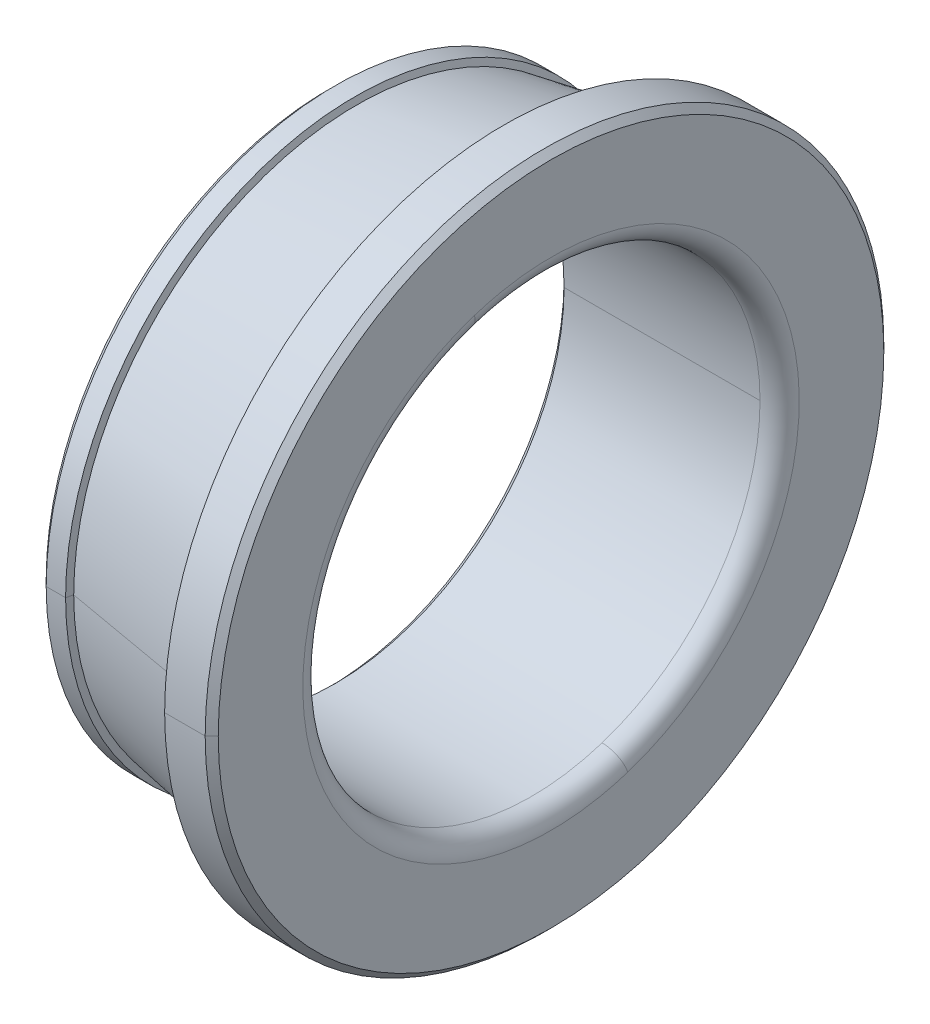
ISO-10303-21;
HEADER;
FILE_DESCRIPTION(('STEP AP214'),'2;1');
FILE_NAME('part.step','',(''),(''),'','','');
FILE_SCHEMA(('AUTOMOTIVE_DESIGN { 1 0 10303 214 1 1 1 1 }'));
ENDSEC;
DATA;
#1=APPLICATION_CONTEXT('core data for automotive mechanical design processes');
#2=APPLICATION_PROTOCOL_DEFINITION('international standard','automotive_design',2000,#1);
#3=PRODUCT_CONTEXT('',#1,'mechanical');
#4=PRODUCT('Part','Part','',(#3));
#5=PRODUCT_RELATED_PRODUCT_CATEGORY('part','',(#4));
#6=PRODUCT_DEFINITION_FORMATION('','',#4);
#7=PRODUCT_DEFINITION_CONTEXT('part definition',#1,'design');
#8=PRODUCT_DEFINITION('design','',#6,#7);
#9=PRODUCT_DEFINITION_SHAPE('','',#8);
#10=(LENGTH_UNIT() NAMED_UNIT(*) SI_UNIT(.MILLI.,.METRE.));
#11=(NAMED_UNIT(*) PLANE_ANGLE_UNIT() SI_UNIT($,.RADIAN.));
#12=(NAMED_UNIT(*) SI_UNIT($,.STERADIAN.) SOLID_ANGLE_UNIT());
#13=UNCERTAINTY_MEASURE_WITH_UNIT(LENGTH_MEASURE(1.E-05),#10,'distance_accuracy_value','');
#14=(GEOMETRIC_REPRESENTATION_CONTEXT(3) GLOBAL_UNCERTAINTY_ASSIGNED_CONTEXT((#13)) GLOBAL_UNIT_ASSIGNED_CONTEXT((#10,
#11,#12)) REPRESENTATION_CONTEXT('',''));
#15=CARTESIAN_POINT('',(0.,0.,0.));
#16=DIRECTION('',(0.,0.,1.));
#17=DIRECTION('',(1.,0.,0.));
#18=AXIS2_PLACEMENT_3D('',#15,#16,#17);
#19=CARTESIAN_POINT('',(1.25,21.646,0.));
#20=DIRECTION('',(-1.,0.,0.));
#21=DIRECTION('',(0.,0.,1.));
#22=AXIS2_PLACEMENT_3D('',#19,#20,#21);
#23=PLANE('',#22);
#24=CARTESIAN_POINT('',(1.25,0.,0.));
#25=DIRECTION('',(1.,0.,0.));
#26=DIRECTION('',(0.,0.,-1.));
#27=AXIS2_PLACEMENT_3D('',#24,#25,#26);
#28=CIRCLE('',#27,18.);
#29=CARTESIAN_POINT('',(1.25,0.,-18.));
#30=VERTEX_POINT('',#29);
#31=CARTESIAN_POINT('',(1.25,0.,18.));
#32=VERTEX_POINT('',#31);
#33=EDGE_CURVE('E11',#30,#32,#28,.T.);
#34=ORIENTED_EDGE('',*,*,#33,.T.);
#35=CARTESIAN_POINT('',(1.25,0.,0.));
#36=DIRECTION('',(1.,0.,0.));
#37=DIRECTION('',(0.,0.,-1.));
#38=AXIS2_PLACEMENT_3D('',#35,#36,#37);
#39=CIRCLE('',#38,18.);
#40=EDGE_CURVE('E25',#32,#30,#39,.T.);
#41=ORIENTED_EDGE('',*,*,#40,.T.);
#42=EDGE_LOOP('',(#34,#41));
#43=FACE_BOUND('',#42,.T.);
#44=CARTESIAN_POINT('',(1.25,0.,0.));
#45=DIRECTION('',(1.,0.,0.));
#46=DIRECTION('',(0.,0.,-1.));
#47=AXIS2_PLACEMENT_3D('',#44,#45,#46);
#48=CIRCLE('',#47,21.646);
#49=CARTESIAN_POINT('',(1.25,0.,21.646));
#50=VERTEX_POINT('',#49);
#51=CARTESIAN_POINT('',(1.25,0.,-21.646));
#52=VERTEX_POINT('',#51);
#53=EDGE_CURVE('E371',#50,#52,#48,.T.);
#54=ORIENTED_EDGE('',*,*,#53,.F.);
#55=CARTESIAN_POINT('',(1.25,0.,0.));
#56=DIRECTION('',(1.,0.,0.));
#57=DIRECTION('',(0.,0.,-1.));
#58=AXIS2_PLACEMENT_3D('',#55,#56,#57);
#59=CIRCLE('',#58,21.646);
#60=EDGE_CURVE('E366',#52,#50,#59,.T.);
#61=ORIENTED_EDGE('',*,*,#60,.F.);
#62=EDGE_LOOP('',(#54,#61));
#63=FACE_BOUND('',#62,.T.);
#64=ADVANCED_FACE('F17',(#43,#63),#23,.T.);
#65=CARTESIAN_POINT('',(1.75,0.,0.));
#66=DIRECTION('',(1.,0.,0.));
#67=DIRECTION('',(0.,-1.,0.));
#68=AXIS2_PLACEMENT_3D('',#65,#66,#67);
#69=CONICAL_SURFACE('',#68,22.146,0.785398163397448);
#70=DIRECTION('',(0.707106781186548,0.,0.707106781186548));
#71=VECTOR('',#70,1.);
#72=CARTESIAN_POINT('',(1.25,0.,21.646));
#73=LINE('',#72,#71);
#74=CARTESIAN_POINT('',(1.75,0.,22.146));
#75=VERTEX_POINT('',#74);
#76=EDGE_CURVE('E362',#50,#75,#73,.T.);
#77=ORIENTED_EDGE('',*,*,#76,.T.);
#78=CARTESIAN_POINT('',(1.75,0.,0.));
#79=DIRECTION('',(1.,0.,0.));
#80=DIRECTION('',(0.,0.,-1.));
#81=AXIS2_PLACEMENT_3D('',#78,#79,#80);
#82=CIRCLE('',#81,22.146);
#83=CARTESIAN_POINT('',(1.75,0.,-22.146));
#84=VERTEX_POINT('',#83);
#85=EDGE_CURVE('E357',#84,#75,#82,.T.);
#86=ORIENTED_EDGE('',*,*,#85,.F.);
#87=DIRECTION('',(0.707106781186548,0.,-0.707106781186548));
#88=VECTOR('',#87,1.);
#89=CARTESIAN_POINT('',(1.25,0.,-21.646));
#90=LINE('',#89,#88);
#91=EDGE_CURVE('E352',#52,#84,#90,.T.);
#92=ORIENTED_EDGE('',*,*,#91,.F.);
#93=ORIENTED_EDGE('',*,*,#60,.T.);
#94=EDGE_LOOP('',(#77,#86,#92,#93));
#95=FACE_BOUND('',#94,.T.);
#96=ADVANCED_FACE('F387',(#95),#69,.T.);
#97=CARTESIAN_POINT('',(1.75,0.,0.));
#98=DIRECTION('',(1.,0.,0.));
#99=DIRECTION('',(0.,1.,0.));
#100=AXIS2_PLACEMENT_3D('',#97,#98,#99);
#101=CONICAL_SURFACE('',#100,22.146,0.785398163397448);
#102=ORIENTED_EDGE('',*,*,#76,.F.);
#103=ORIENTED_EDGE('',*,*,#53,.T.);
#104=ORIENTED_EDGE('',*,*,#91,.T.);
#105=CARTESIAN_POINT('',(1.75,0.,0.));
#106=DIRECTION('',(1.,0.,0.));
#107=DIRECTION('',(0.,0.,-1.));
#108=AXIS2_PLACEMENT_3D('',#105,#106,#107);
#109=CIRCLE('',#108,22.146);
#110=EDGE_CURVE('E347',#75,#84,#109,.T.);
#111=ORIENTED_EDGE('',*,*,#110,.F.);
#112=EDGE_LOOP('',(#102,#103,#104,#111));
#113=FACE_BOUND('',#112,.T.);
#114=ADVANCED_FACE('F382',(#113),#101,.T.);
#115=CARTESIAN_POINT('',(18.25,0.,0.));
#116=DIRECTION('',(1.,0.,0.));
#117=DIRECTION('',(0.,1.,0.));
#118=AXIS2_PLACEMENT_3D('',#115,#116,#117);
#119=CYLINDRICAL_SURFACE('',#118,22.146);
#120=DIRECTION('',(1.,0.,0.));
#121=VECTOR('',#120,1.);
#122=CARTESIAN_POINT('',(1.75,0.,22.146));
#123=LINE('',#122,#121);
#124=CARTESIAN_POINT('',(3.2342881185067,0.,22.146));
#125=VERTEX_POINT('',#124);
#126=EDGE_CURVE('E342',#75,#125,#123,.T.);
#127=ORIENTED_EDGE('',*,*,#126,.F.);
#128=ORIENTED_EDGE('',*,*,#110,.T.);
#129=DIRECTION('',(1.,0.,0.));
#130=VECTOR('',#129,1.);
#131=CARTESIAN_POINT('',(1.75,0.,-22.146));
#132=LINE('',#131,#130);
#133=CARTESIAN_POINT('',(3.2342881185067,0.,-22.146));
#134=VERTEX_POINT('',#133);
#135=EDGE_CURVE('E338',#84,#134,#132,.T.);
#136=ORIENTED_EDGE('',*,*,#135,.T.);
#137=CARTESIAN_POINT('',(3.2342881185067,0.,0.));
#138=DIRECTION('',(1.,0.,0.));
#139=DIRECTION('',(0.,0.,-1.));
#140=AXIS2_PLACEMENT_3D('',#137,#138,#139);
#141=CIRCLE('',#140,22.146);
#142=EDGE_CURVE('E333',#125,#134,#141,.T.);
#143=ORIENTED_EDGE('',*,*,#142,.F.);
#144=EDGE_LOOP('',(#127,#128,#136,#143));
#145=FACE_BOUND('',#144,.T.);
#146=ADVANCED_FACE('F394',(#145),#119,.T.);
#147=CARTESIAN_POINT('',(3.3586854900506,0.,0.));
#148=DIRECTION('',(-1.,0.,0.));
#149=DIRECTION('',(0.,1.,0.));
#150=AXIS2_PLACEMENT_3D('',#147,#148,#149);
#151=CONICAL_SURFACE('',#150,21.648401527406,1.325821912985);
#152=DIRECTION('',(-0.242531502591153,0.,-0.970143530747321));
#153=VECTOR('',#152,1.);
#154=CARTESIAN_POINT('',(3.3586854900506,0.,-21.648401527406));
#155=LINE('',#154,#153);
#156=CARTESIAN_POINT('',(3.3586854900506,0.,-21.648401527406));
#157=VERTEX_POINT('',#156);
#158=EDGE_CURVE('E328',#157,#134,#155,.T.);
#159=ORIENTED_EDGE('',*,*,#158,.F.);
#160=CARTESIAN_POINT('',(3.3586854900506,0.,0.));
#161=DIRECTION('',(1.,0.,0.));
#162=DIRECTION('',(0.,0.,-1.));
#163=AXIS2_PLACEMENT_3D('',#160,#161,#162);
#164=CIRCLE('',#163,21.648401527406);
#165=CARTESIAN_POINT('',(3.3586854900506,0.,21.648401527406));
#166=VERTEX_POINT('',#165);
#167=EDGE_CURVE('E323',#166,#157,#164,.T.);
#168=ORIENTED_EDGE('',*,*,#167,.F.);
#169=DIRECTION('',(-0.242531502591153,0.,0.970143530747321));
#170=VECTOR('',#169,1.);
#171=CARTESIAN_POINT('',(3.3586854900506,0.,21.648401527406));
#172=LINE('',#171,#170);
#173=EDGE_CURVE('E318',#166,#125,#172,.T.);
#174=ORIENTED_EDGE('',*,*,#173,.T.);
#175=ORIENTED_EDGE('',*,*,#142,.T.);
#176=EDGE_LOOP('',(#159,#168,#174,#175));
#177=FACE_BOUND('',#176,.T.);
#178=ADVANCED_FACE('F396',(#177),#151,.T.);
#179=CARTESIAN_POINT('',(3.3586854900506,0.,0.));
#180=DIRECTION('',(-1.,0.,0.));
#181=DIRECTION('',(0.,-1.,0.));
#182=AXIS2_PLACEMENT_3D('',#179,#180,#181);
#183=CONICAL_SURFACE('',#182,21.648401527406,1.325821912985);
#184=ORIENTED_EDGE('',*,*,#158,.T.);
#185=CARTESIAN_POINT('',(3.2342881185067,0.,0.));
#186=DIRECTION('',(1.,0.,0.));
#187=DIRECTION('',(0.,0.,-1.));
#188=AXIS2_PLACEMENT_3D('',#185,#186,#187);
#189=CIRCLE('',#188,22.146);
#190=EDGE_CURVE('E313',#134,#125,#189,.T.);
#191=ORIENTED_EDGE('',*,*,#190,.T.);
#192=ORIENTED_EDGE('',*,*,#173,.F.);
#193=CARTESIAN_POINT('',(3.3586854900506,0.,0.));
#194=DIRECTION('',(1.,0.,0.));
#195=DIRECTION('',(0.,0.,-1.));
#196=AXIS2_PLACEMENT_3D('',#193,#194,#195);
#197=CIRCLE('',#196,21.648401527406);
#198=EDGE_CURVE('E308',#157,#166,#197,.T.);
#199=ORIENTED_EDGE('',*,*,#198,.F.);
#200=EDGE_LOOP('',(#184,#191,#192,#199));
#201=FACE_BOUND('',#200,.T.);
#202=ADVANCED_FACE('F401',(#201),#183,.T.);
#203=CARTESIAN_POINT('',(15.204533853956,0.,0.));
#204=DIRECTION('',(1.,0.,0.));
#205=DIRECTION('',(0.,-1.,0.));
#206=AXIS2_PLACEMENT_3D('',#203,#204,#205);
#207=CONICAL_SURFACE('',#206,23.742260832766,0.174951804219916);
#208=DIRECTION('',(0.984734929038763,0.,0.17406067772769));
#209=VECTOR('',#208,1.);
#210=CARTESIAN_POINT('',(3.3586854900506,0.,21.648401527406));
#211=LINE('',#210,#209);
#212=CARTESIAN_POINT('',(15.204533853956,0.,23.742260832766));
#213=VERTEX_POINT('',#212);
#214=EDGE_CURVE('E304',#166,#213,#211,.T.);
#215=ORIENTED_EDGE('',*,*,#214,.T.);
#216=CARTESIAN_POINT('',(15.204533853956,0.,0.));
#217=DIRECTION('',(1.,0.,0.));
#218=DIRECTION('',(0.,0.,-1.));
#219=AXIS2_PLACEMENT_3D('',#216,#217,#218);
#220=CIRCLE('',#219,23.742260832766);
#221=CARTESIAN_POINT('',(15.204533853956,0.,-23.742260832766));
#222=VERTEX_POINT('',#221);
#223=EDGE_CURVE('E299',#222,#213,#220,.T.);
#224=ORIENTED_EDGE('',*,*,#223,.F.);
#225=DIRECTION('',(0.984734929038763,0.,-0.17406067772769));
#226=VECTOR('',#225,1.);
#227=CARTESIAN_POINT('',(3.3586854900506,0.,-21.648401527406));
#228=LINE('',#227,#226);
#229=EDGE_CURVE('E294',#157,#222,#228,.T.);
#230=ORIENTED_EDGE('',*,*,#229,.F.);
#231=ORIENTED_EDGE('',*,*,#198,.T.);
#232=EDGE_LOOP('',(#215,#224,#230,#231));
#233=FACE_BOUND('',#232,.T.);
#234=ADVANCED_FACE('F408',(#233),#207,.T.);
#235=CARTESIAN_POINT('',(15.204533853956,0.,0.));
#236=DIRECTION('',(1.,0.,0.));
#237=DIRECTION('',(0.,1.,0.));
#238=AXIS2_PLACEMENT_3D('',#235,#236,#237);
#239=CONICAL_SURFACE('',#238,23.742260832766,0.174951804219916);
#240=ORIENTED_EDGE('',*,*,#214,.F.);
#241=ORIENTED_EDGE('',*,*,#167,.T.);
#242=ORIENTED_EDGE('',*,*,#229,.T.);
#243=CARTESIAN_POINT('',(15.204533853956,0.,0.));
#244=DIRECTION('',(1.,0.,0.));
#245=DIRECTION('',(0.,0.,-1.));
#246=AXIS2_PLACEMENT_3D('',#243,#244,#245);
#247=CIRCLE('',#246,23.742260832766);
#248=EDGE_CURVE('E289',#213,#222,#247,.T.);
#249=ORIENTED_EDGE('',*,*,#248,.F.);
#250=EDGE_LOOP('',(#240,#241,#242,#249));
#251=FACE_BOUND('',#250,.T.);
#252=ADVANCED_FACE('F405',(#251),#239,.T.);
#253=CARTESIAN_POINT('',(14.646359142729,0.,0.));
#254=DIRECTION('',(-1.,0.,0.));
#255=DIRECTION('',(0.,1.,0.));
#256=AXIS2_PLACEMENT_3D('',#253,#254,#255);
#257=CONICAL_SURFACE('',#256,25.975,1.3258219129849);
#258=DIRECTION('',(-0.242531502591256,0.,-0.970143530747295));
#259=VECTOR('',#258,1.);
#260=CARTESIAN_POINT('',(15.204533853956,0.,-23.742260832766));
#261=LINE('',#260,#259);
#262=CARTESIAN_POINT('',(14.646359142729,0.,-25.975));
#263=VERTEX_POINT('',#262);
#264=EDGE_CURVE('E285',#222,#263,#261,.T.);
#265=ORIENTED_EDGE('',*,*,#264,.T.);
#266=CARTESIAN_POINT('',(14.646359142729,0.,0.));
#267=DIRECTION('',(1.,0.,0.));
#268=DIRECTION('',(0.,0.,-1.));
#269=AXIS2_PLACEMENT_3D('',#266,#267,#268);
#270=CIRCLE('',#269,25.975);
#271=CARTESIAN_POINT('',(14.646359142729,0.,25.975));
#272=VERTEX_POINT('',#271);
#273=EDGE_CURVE('E280',#272,#263,#270,.T.);
#274=ORIENTED_EDGE('',*,*,#273,.F.);
#275=DIRECTION('',(-0.242531502591256,0.,0.970143530747295));
#276=VECTOR('',#275,1.);
#277=CARTESIAN_POINT('',(15.204533853956,0.,23.742260832766));
#278=LINE('',#277,#276);
#279=EDGE_CURVE('E275',#213,#272,#278,.T.);
#280=ORIENTED_EDGE('',*,*,#279,.F.);
#281=ORIENTED_EDGE('',*,*,#248,.T.);
#282=EDGE_LOOP('',(#265,#274,#280,#281));
#283=FACE_BOUND('',#282,.T.);
#284=ADVANCED_FACE('F410',(#283),#257,.F.);
#285=CARTESIAN_POINT('',(14.646359142729,0.,0.));
#286=DIRECTION('',(-1.,0.,0.));
#287=DIRECTION('',(0.,-1.,0.));
#288=AXIS2_PLACEMENT_3D('',#285,#286,#287);
#289=CONICAL_SURFACE('',#288,25.975,1.3258219129849);
#290=ORIENTED_EDGE('',*,*,#264,.F.);
#291=ORIENTED_EDGE('',*,*,#223,.T.);
#292=ORIENTED_EDGE('',*,*,#279,.T.);
#293=CARTESIAN_POINT('',(14.646359142729,0.,0.));
#294=DIRECTION('',(1.,0.,0.));
#295=DIRECTION('',(0.,0.,-1.));
#296=AXIS2_PLACEMENT_3D('',#293,#294,#295);
#297=CIRCLE('',#296,25.975);
#298=EDGE_CURVE('E270',#263,#272,#297,.T.);
#299=ORIENTED_EDGE('',*,*,#298,.F.);
#300=EDGE_LOOP('',(#290,#291,#292,#299));
#301=FACE_BOUND('',#300,.T.);
#302=ADVANCED_FACE('F415',(#301),#289,.F.);
#303=CARTESIAN_POINT('',(18.25,0.,0.));
#304=DIRECTION('',(1.,0.,0.));
#305=DIRECTION('',(0.,-1.,0.));
#306=AXIS2_PLACEMENT_3D('',#303,#304,#305);
#307=CYLINDRICAL_SURFACE('',#306,25.975);
#308=DIRECTION('',(1.,0.,0.));
#309=VECTOR('',#308,1.);
#310=CARTESIAN_POINT('',(14.646359142729,0.,25.975));
#311=LINE('',#310,#309);
#312=CARTESIAN_POINT('',(17.75,0.,25.975));
#313=VERTEX_POINT('',#312);
#314=EDGE_CURVE('E266',#272,#313,#311,.T.);
#315=ORIENTED_EDGE('',*,*,#314,.T.);
#316=CARTESIAN_POINT('',(17.75,0.,0.));
#317=DIRECTION('',(1.,0.,0.));
#318=DIRECTION('',(0.,0.,-1.));
#319=AXIS2_PLACEMENT_3D('',#316,#317,#318);
#320=CIRCLE('',#319,25.975);
#321=CARTESIAN_POINT('',(17.75,0.,-25.975));
#322=VERTEX_POINT('',#321);
#323=EDGE_CURVE('E261',#322,#313,#320,.T.);
#324=ORIENTED_EDGE('',*,*,#323,.F.);
#325=DIRECTION('',(1.,0.,0.));
#326=VECTOR('',#325,1.);
#327=CARTESIAN_POINT('',(14.646359142729,0.,-25.975));
#328=LINE('',#327,#326);
#329=EDGE_CURVE('E256',#263,#322,#328,.T.);
#330=ORIENTED_EDGE('',*,*,#329,.F.);
#331=ORIENTED_EDGE('',*,*,#298,.T.);
#332=EDGE_LOOP('',(#315,#324,#330,#331));
#333=FACE_BOUND('',#332,.T.);
#334=ADVANCED_FACE('F421',(#333),#307,.T.);
#335=CARTESIAN_POINT('',(18.25,0.,0.));
#336=DIRECTION('',(1.,0.,0.));
#337=DIRECTION('',(0.,1.,0.));
#338=AXIS2_PLACEMENT_3D('',#335,#336,#337);
#339=CYLINDRICAL_SURFACE('',#338,25.975);
#340=ORIENTED_EDGE('',*,*,#314,.F.);
#341=ORIENTED_EDGE('',*,*,#273,.T.);
#342=ORIENTED_EDGE('',*,*,#329,.T.);
#343=CARTESIAN_POINT('',(17.75,0.,0.));
#344=DIRECTION('',(1.,0.,0.));
#345=DIRECTION('',(0.,0.,-1.));
#346=AXIS2_PLACEMENT_3D('',#343,#344,#345);
#347=CIRCLE('',#346,25.975);
#348=EDGE_CURVE('E251',#313,#322,#347,.T.);
#349=ORIENTED_EDGE('',*,*,#348,.F.);
#350=EDGE_LOOP('',(#340,#341,#342,#349));
#351=FACE_BOUND('',#350,.T.);
#352=ADVANCED_FACE('F419',(#351),#339,.T.);
#353=CARTESIAN_POINT('',(18.25,0.,0.));
#354=DIRECTION('',(-1.,0.,0.));
#355=DIRECTION('',(0.,1.,0.));
#356=AXIS2_PLACEMENT_3D('',#353,#354,#355);
#357=CONICAL_SURFACE('',#356,25.475,0.785398163397452);
#358=DIRECTION('',(-0.707106781186545,0.,-0.70710678118655));
#359=VECTOR('',#358,1.);
#360=CARTESIAN_POINT('',(18.25,0.,-25.475));
#361=LINE('',#360,#359);
#362=CARTESIAN_POINT('',(18.25,0.,-25.475));
#363=VERTEX_POINT('',#362);
#364=EDGE_CURVE('E246',#363,#322,#361,.T.);
#365=ORIENTED_EDGE('',*,*,#364,.F.);
#366=CARTESIAN_POINT('',(18.25,0.,0.));
#367=DIRECTION('',(1.,0.,0.));
#368=DIRECTION('',(0.,0.,-1.));
#369=AXIS2_PLACEMENT_3D('',#366,#367,#368);
#370=CIRCLE('',#369,25.475);
#371=CARTESIAN_POINT('',(18.25,0.,25.475));
#372=VERTEX_POINT('',#371);
#373=EDGE_CURVE('E241',#372,#363,#370,.T.);
#374=ORIENTED_EDGE('',*,*,#373,.F.);
#375=DIRECTION('',(-0.707106781186545,0.,0.70710678118655));
#376=VECTOR('',#375,1.);
#377=CARTESIAN_POINT('',(18.25,0.,25.475));
#378=LINE('',#377,#376);
#379=EDGE_CURVE('E236',#372,#313,#378,.T.);
#380=ORIENTED_EDGE('',*,*,#379,.T.);
#381=ORIENTED_EDGE('',*,*,#348,.T.);
#382=EDGE_LOOP('',(#365,#374,#380,#381));
#383=FACE_BOUND('',#382,.T.);
#384=ADVANCED_FACE('F427',(#383),#357,.T.);
#385=CARTESIAN_POINT('',(18.25,0.,0.));
#386=DIRECTION('',(-1.,0.,0.));
#387=DIRECTION('',(0.,-1.,0.));
#388=AXIS2_PLACEMENT_3D('',#385,#386,#387);
#389=CONICAL_SURFACE('',#388,25.475,0.785398163397452);
#390=ORIENTED_EDGE('',*,*,#364,.T.);
#391=ORIENTED_EDGE('',*,*,#323,.T.);
#392=ORIENTED_EDGE('',*,*,#379,.F.);
#393=CARTESIAN_POINT('',(18.25,0.,0.));
#394=DIRECTION('',(1.,0.,0.));
#395=DIRECTION('',(0.,0.,-1.));
#396=AXIS2_PLACEMENT_3D('',#393,#394,#395);
#397=CIRCLE('',#396,25.475);
#398=EDGE_CURVE('E233',#363,#372,#397,.T.);
#399=ORIENTED_EDGE('',*,*,#398,.F.);
#400=EDGE_LOOP('',(#390,#391,#392,#399));
#401=FACE_BOUND('',#400,.T.);
#402=ADVANCED_FACE('F424',(#401),#389,.T.);
#403=CARTESIAN_POINT('',(18.25,19.,0.));
#404=DIRECTION('',(1.,0.,0.));
#405=DIRECTION('',(0.,0.,-1.));
#406=AXIS2_PLACEMENT_3D('',#403,#404,#405);
#407=PLANE('',#406);
#408=ORIENTED_EDGE('',*,*,#398,.T.);
#409=ORIENTED_EDGE('',*,*,#373,.T.);
#410=EDGE_LOOP('',(#408,#409));
#411=FACE_BOUND('',#410,.T.);
#412=CARTESIAN_POINT('',(18.25,-18.0700738096073,-5.87132289312385));
#413=CARTESIAN_POINT('',(18.25,-17.9740106883257,-6.1669961208765));
#414=CARTESIAN_POINT('',(18.25,-17.8706785644181,-6.46030691648312));
#415=CARTESIAN_POINT('',(18.25,-17.6497523450558,-7.04150733217232));
#416=CARTESIAN_POINT('',(18.25,-17.532158249601,-7.3293969522549));
#417=CARTESIAN_POINT('',(18.25,-17.282984120849,-7.89905870566403));
#418=CARTESIAN_POINT('',(18.25,-17.1514040875517,-8.18083083899057));
#419=CARTESIAN_POINT('',(18.25,-16.8745770164577,-8.73757954465673));
#420=CARTESIAN_POINT('',(18.25,-16.7293299786609,-9.01255611699636));
#421=CARTESIAN_POINT('',(18.25,-16.4255182901043,-9.55505105988739));
#422=CARTESIAN_POINT('',(18.25,-16.2669536393443,-9.8225694304388));
#423=CARTESIAN_POINT('',(18.25,-15.9368888606755,-10.349503547662));
#424=CARTESIAN_POINT('',(18.25,-15.7653887327666,-10.6089192943337));
#425=CARTESIAN_POINT('',(18.25,-15.4098661212019,-11.1190231943149));
#426=CARTESIAN_POINT('',(18.25,-15.2258436375461,-11.3697113476243));
#427=CARTESIAN_POINT('',(18.25,-14.845719650798,-11.861756134974));
#428=CARTESIAN_POINT('',(18.25,-14.6496181477056,-12.1031127690142));
#429=CARTESIAN_POINT('',(18.25,-14.2458085450946,-12.5759130675321));
#430=CARTESIAN_POINT('',(18.25,-14.0381004455759,-12.8073567320098));
#431=CARTESIAN_POINT('',(18.25,-13.611578037837,-13.2597735236167));
#432=CARTESIAN_POINT('',(18.25,-13.3927637296169,-13.4807466507459));
#433=CARTESIAN_POINT('',(18.25,-12.9445560471164,-13.9116900239642));
#434=CARTESIAN_POINT('',(18.25,-12.7151626728362,-14.1216602700532));
#435=CARTESIAN_POINT('',(18.25,-12.2463494869985,-14.5300920444969));
#436=CARTESIAN_POINT('',(18.25,-12.0069296754411,-14.7285535728515));
#437=CARTESIAN_POINT('',(18.25,-11.5186403983318,-15.1134898006159));
#438=CARTESIAN_POINT('',(18.25,-11.26977093278,-15.2999645000257));
#439=CARTESIAN_POINT('',(18.25,-10.7631818960268,-15.6604778360179));
#440=CARTESIAN_POINT('',(18.25,-10.5054623248252,-15.8345164726003));
#441=CARTESIAN_POINT('',(18.25,-9.9817939457921,-16.1697384086176));
#442=CARTESIAN_POINT('',(18.25,-9.71584513796047,-16.3309217080526));
#443=CARTESIAN_POINT('',(18.25,-9.17635897963978,-16.640044665089));
#444=CARTESIAN_POINT('',(18.25,-8.90282162915072,-16.7879843226904));
#445=CARTESIAN_POINT('',(18.25,-8.34881736095149,-17.0702635964665));
#446=CARTESIAN_POINT('',(18.25,-8.06835044324131,-17.2046032126411));
#447=CARTESIAN_POINT('',(18.25,-7.5011627099706,-17.4593587676615));
#448=CARTESIAN_POINT('',(18.25,-7.21444189441008,-17.5797747065073));
#449=CARTESIAN_POINT('',(18.25,-6.63543710099715,-17.8063928143261));
#450=CARTESIAN_POINT('',(18.25,-6.34315312314475,-17.9125949832991));
#451=CARTESIAN_POINT('',(18.25,-5.75372614285175,-18.1105297010451));
#452=CARTESIAN_POINT('',(18.25,-5.45658314041116,-18.2022622498181));
#453=CARTESIAN_POINT('',(18.25,-4.85815395446133,-18.3710367354193));
#454=CARTESIAN_POINT('',(18.25,-4.55686777095209,-18.4480786722475));
#455=CARTESIAN_POINT('',(18.25,-3.95087804767059,-18.5872863331851));
#456=CARTESIAN_POINT('',(18.25,-3.64617450789832,-18.6494520572945));
#457=CARTESIAN_POINT('',(18.25,-3.03408412960695,-18.7587575301202));
#458=CARTESIAN_POINT('',(18.25,-2.72669729108785,-18.8058972788364));
#459=CARTESIAN_POINT('',(18.25,-2.10998083712071,-18.8850372370921));
#460=CARTESIAN_POINT('',(18.25,-1.80065122167267,-18.9170374466316));
#461=CARTESIAN_POINT('',(18.25,-1.18079441598535,-18.9658212352261));
#462=CARTESIAN_POINT('',(18.25,-0.870267225746063,-18.982604814281));
#463=CARTESIAN_POINT('',(18.25,-0.248763357676506,-19.0009149087946));
#464=CARTESIAN_POINT('',(18.25,0.0622133201537652,-19.0024414242531));
#465=CARTESIAN_POINT('',(18.25,0.683866993350071,-18.9902337140642));
#466=CARTESIAN_POINT('',(18.25,0.994543988716105,-18.9764994884168));
#467=CARTESIAN_POINT('',(18.25,1.61484984889,-18.9338033829686));
#468=CARTESIAN_POINT('',(18.25,1.92447871369786,-18.9048415031678));
#469=CARTESIAN_POINT('',(18.25,2.5419423896998,-18.8317598611182));
#470=CARTESIAN_POINT('',(18.25,2.84977720089388,-18.7876400988692));
#471=CARTESIAN_POINT('',(18.25,3.46291116864497,-18.6843489802949));
#472=CARTESIAN_POINT('',(18.25,3.76821032520196,-18.6251776239695));
#473=CARTESIAN_POINT('',(18.25,4.37553749126967,-18.4919258662225));
#474=CARTESIAN_POINT('',(18.25,4.67756550078038,-18.4178454648008));
#475=CARTESIAN_POINT('',(18.25,5.27762276082609,-18.2549540830369));
#476=CARTESIAN_POINT('',(18.25,5.57565201136108,-18.1661431026946));
#477=CARTESIAN_POINT('',(18.25,6.16699377488651,-17.9740045165201));
#478=CARTESIAN_POINT('',(18.25,6.46030628787696,-17.8706769106878));
#479=CARTESIAN_POINT('',(18.25,7.04150796077838,-17.6497539987862));
#480=CARTESIAN_POINT('',(18.25,7.32939712068935,-17.5321586927168));
#481=CARTESIAN_POINT('',(18.25,7.89905853722948,-17.2829836777333));
#482=CARTESIAN_POINT('',(18.25,8.18083079385864,-17.1514039688192));
#483=CARTESIAN_POINT('',(18.25,8.73757958978858,-16.8745771351902));
#484=CARTESIAN_POINT('',(18.25,9.01255612908936,-16.7293300104752));
#485=CARTESIAN_POINT('',(18.25,9.55505104779429,-16.42551825829));
#486=CARTESIAN_POINT('',(18.25,9.82256942719843,-16.2669536308198));
#487=CARTESIAN_POINT('',(18.25,10.3495035509022,-15.9368888692002));
#488=CARTESIAN_POINT('',(18.25,10.6089192952019,-15.7653887350508));
#489=CARTESIAN_POINT('',(18.25,11.1190231934466,-15.4098661189178));
#490=CARTESIAN_POINT('',(18.25,11.3697113473917,-15.2258436369341));
#491=CARTESIAN_POINT('',(18.25,11.8617561352066,-14.8457196514101));
#492=CARTESIAN_POINT('',(18.25,12.1031127690765,-14.6496181478697));
#493=CARTESIAN_POINT('',(18.25,12.5759130674697,-14.2458085449306));
#494=CARTESIAN_POINT('',(18.25,12.8073567319931,-14.038100445532));
#495=CARTESIAN_POINT('',(18.25,13.2597735236334,-13.611578037881));
#496=CARTESIAN_POINT('',(18.25,13.4807466507503,-13.3927637296287));
#497=CARTESIAN_POINT('',(18.25,13.9116900239597,-12.9445560471047));
#498=CARTESIAN_POINT('',(18.25,14.121660270052,-12.7151626728331));
#499=CARTESIAN_POINT('',(18.25,14.5300920444981,-12.2463494870017));
#500=CARTESIAN_POINT('',(18.25,14.7285535728518,-12.006929675442));
#501=CARTESIAN_POINT('',(18.25,15.1134898006155,-11.518640398331));
#502=CARTESIAN_POINT('',(18.25,15.2999645000256,-11.2697709327799));
#503=CARTESIAN_POINT('',(18.25,15.660477836018,-10.763181896027));
#504=CARTESIAN_POINT('',(18.25,15.8345164726003,-10.5054623248254));
#505=CARTESIAN_POINT('',(18.25,16.1697384086176,-9.98179394579209));
#506=CARTESIAN_POINT('',(18.25,16.3309217080526,-9.71584513796051));
#507=CARTESIAN_POINT('',(18.25,16.640044665089,-9.17635897963985));
#508=CARTESIAN_POINT('',(18.25,16.7879843226904,-8.90282162915078));
#509=CARTESIAN_POINT('',(18.25,17.0702635964665,-8.34881736095154));
#510=CARTESIAN_POINT('',(18.25,17.2046032126411,-8.06835044324136));
#511=CARTESIAN_POINT('',(18.25,17.4593587676615,-7.50116270997065));
#512=CARTESIAN_POINT('',(18.25,17.5797747065074,-7.21444189441012));
#513=CARTESIAN_POINT('',(18.25,17.806392814326,-6.63543710099722));
#514=CARTESIAN_POINT('',(18.25,17.9125949832989,-6.34315312314486));
#515=CARTESIAN_POINT('',(18.25,18.1105297010454,-5.75372614285174));
#516=CARTESIAN_POINT('',(18.25,18.202262249819,-5.45658314041098));
#517=CARTESIAN_POINT('',(18.25,18.3710367354184,-4.85815395446162));
#518=CARTESIAN_POINT('',(18.25,18.4480786722442,-4.55686777095303));
#519=CARTESIAN_POINT('',(18.25,18.5872863331883,-3.95087804766975));
#520=CARTESIAN_POINT('',(18.25,18.6494520573067,-3.64617450789507));
#521=CARTESIAN_POINT('',(18.25,18.758757530108,-3.03408412961031));
#522=CARTESIAN_POINT('',(18.25,18.8058972787911,-2.72669729110022));
#523=CARTESIAN_POINT('',(18.25,18.8850372371375,-2.10998083710845));
#524=CARTESIAN_POINT('',(18.25,18.9170374468009,-1.80065122162677));
#525=CARTESIAN_POINT('',(18.25,18.9658212350567,-1.18079441603137));
#526=CARTESIAN_POINT('',(18.25,18.9826048136491,-0.870267225917663));
#527=CARTESIAN_POINT('',(18.25,19.0009149094265,-0.248763357505038));
#528=CARTESIAN_POINT('',(18.25,19.0024414266113,0.0622133207938759));
#529=CARTESIAN_POINT('',(18.25,18.9902337117059,0.683866992709833));
#530=CARTESIAN_POINT('',(18.25,18.9764994796156,0.994543986326876));
#531=CARTESIAN_POINT('',(18.25,18.9338033917698,1.6148498512791));
#532=CARTESIAN_POINT('',(18.25,18.9048415360143,1.92447872261428));
#533=CARTESIAN_POINT('',(18.25,18.8317598282718,2.54194238078328));
#534=CARTESIAN_POINT('',(18.25,18.7876399762848,2.8497771676171));
#535=CARTESIAN_POINT('',(18.25,18.6843491028794,3.46291120192167));
#536=CARTESIAN_POINT('',(18.25,18.625178081461,3.76821044939242));
#537=CARTESIAN_POINT('',(18.25,18.491925408731,4.37553736707912));
#538=CARTESIAN_POINT('',(18.25,18.4178437574195,4.67756503729506));
#539=CARTESIAN_POINT('',(18.25,18.2549557904182,5.27762322431132));
#540=CARTESIAN_POINT('',(18.25,18.1661494747286,5.57565374111164));
#541=CARTESIAN_POINT('',(18.25,18.0700738096074,5.87132289312374));
#542=B_SPLINE_CURVE_WITH_KNOTS('',3,(#412,#413,#414,#415,#416,#417,#418,#419,#420,#421,#422,
#423,#424,#425,#426,#427,#428,#429,#430,#431,#432,#433,#434,#435,#436,#437,#438,#439,#440,#441,
#442,#443,#444,#445,#446,#447,#448,#449,#450,#451,#452,#453,#454,#455,#456,#457,#458,#459,#460,
#461,#462,#463,#464,#465,#466,#467,#468,#469,#470,#471,#472,#473,#474,#475,#476,#477,#478,#479,
#480,#481,#482,#483,#484,#485,#486,#487,#488,#489,#490,#491,#492,#493,#494,#495,#496,#497,#498,
#499,#500,#501,#502,#503,#504,#505,#506,#507,#508,#509,#510,#511,#512,#513,#514,#515,#516,#517,
#518,#519,#520,#521,#522,#523,#524,#525,#526,#527,#528,#529,#530,#531,#532,#533,#534,#535,#536,
#537,#538,#539,#540,#541),.UNSPECIFIED.,.F.,.F.,(4,2,2,2,2,2,2,2,2,2,2,2,2,2,2,2,2,2,2,2,2,2,2,
2,2,2,2,2,2,2,2,2,2,2,2,2,2,2,2,2,2,2,2,2,2,2,2,2,2,2,2,2,2,2,2,2,2,2,2,2,2,2,2,2,4),(0.,
0.932566683870634,1.86513336774127,2.79770005161191,3.73026673548254,4.66283341935317,
5.59540010322381,6.52796678709445,7.46053347096509,8.39310015483572,9.32566683870635,
10.258233522577,11.1908002064476,12.1233668903183,13.0559335741889,13.9885002580595,
14.9210669419302,15.8536336258008,16.7862003096714,17.7187669935421,18.6513336774127,
19.5839003612833,20.516467045154,21.4490337290246,22.3816004128953,23.3141670967659,
24.2467337806365,25.1793004645072,26.1118671483778,27.0444338322484,27.9770005161191,
28.9095671999897,29.8421338838603,30.774700567731,31.7072672516016,32.6398339354722,
33.5724006193429,34.5049673032135,35.4375339870842,36.3701006709548,37.3026673548254,
38.2352340386961,39.1678007225667,40.1003674064373,41.032934090308,41.9655007741786,
42.8980674580492,43.8306341419199,44.7632008257905,45.6957675096612,46.6283341935318,
47.5609008774024,48.4934675612731,49.4260342451437,50.3586009290143,51.291167612885,
52.2237342967556,53.1563009806262,54.0888676644969,55.0214343483675,55.9540010322382,
56.8865677161088,57.8191343999794,58.7517010838501,59.6842677677207),.UNSPECIFIED.);
#543=CARTESIAN_POINT('',(18.25,-18.0700738096073,-5.87132289312381));
#544=VERTEX_POINT('',#543);
#545=CARTESIAN_POINT('',(18.25,18.0700738096073,5.87132289312381));
#546=VERTEX_POINT('',#545);
#547=EDGE_CURVE('E232',#544,#546,#542,.T.);
#548=ORIENTED_EDGE('',*,*,#547,.F.);
#549=CARTESIAN_POINT('',(18.25,18.0700738096073,5.87132289312385));
#550=CARTESIAN_POINT('',(18.25,17.9740106883257,6.1669961208765));
#551=CARTESIAN_POINT('',(18.25,17.8706785644181,6.46030691648312));
#552=CARTESIAN_POINT('',(18.25,17.6497523450558,7.04150733217232));
#553=CARTESIAN_POINT('',(18.25,17.532158249601,7.3293969522549));
#554=CARTESIAN_POINT('',(18.25,17.282984120849,7.89905870566403));
#555=CARTESIAN_POINT('',(18.25,17.1514040875517,8.18083083899057));
#556=CARTESIAN_POINT('',(18.25,16.8745770164577,8.73757954465674));
#557=CARTESIAN_POINT('',(18.25,16.7293299786609,9.01255611699636));
#558=CARTESIAN_POINT('',(18.25,16.4255182901043,9.55505105988739));
#559=CARTESIAN_POINT('',(18.25,16.2669536393443,9.8225694304388));
#560=CARTESIAN_POINT('',(18.25,15.9368888606755,10.349503547662));
#561=CARTESIAN_POINT('',(18.25,15.7653887327666,10.6089192943337));
#562=CARTESIAN_POINT('',(18.25,15.4098661212019,11.1190231943149));
#563=CARTESIAN_POINT('',(18.25,15.2258436375461,11.3697113476244));
#564=CARTESIAN_POINT('',(18.25,14.845719650798,11.861756134974));
#565=CARTESIAN_POINT('',(18.25,14.6496181477056,12.1031127690142));
#566=CARTESIAN_POINT('',(18.25,14.2458085450946,12.5759130675321));
#567=CARTESIAN_POINT('',(18.25,14.0381004455759,12.8073567320098));
#568=CARTESIAN_POINT('',(18.25,13.611578037837,13.2597735236167));
#569=CARTESIAN_POINT('',(18.25,13.3927637296168,13.4807466507459));
#570=CARTESIAN_POINT('',(18.25,12.9445560471164,13.9116900239642));
#571=CARTESIAN_POINT('',(18.25,12.7151626728362,14.1216602700533));
#572=CARTESIAN_POINT('',(18.25,12.2463494869985,14.5300920444969));
#573=CARTESIAN_POINT('',(18.25,12.0069296754411,14.7285535728515));
#574=CARTESIAN_POINT('',(18.25,11.5186403983318,15.1134898006159));
#575=CARTESIAN_POINT('',(18.25,11.26977093278,15.2999645000257));
#576=CARTESIAN_POINT('',(18.25,10.7631818960267,15.6604778360179));
#577=CARTESIAN_POINT('',(18.25,10.5054623248252,15.8345164726003));
#578=CARTESIAN_POINT('',(18.25,9.98179394579209,16.1697384086176));
#579=CARTESIAN_POINT('',(18.25,9.71584513796046,16.3309217080526));
#580=CARTESIAN_POINT('',(18.25,9.17635897963977,16.640044665089));
#581=CARTESIAN_POINT('',(18.25,8.90282162915072,16.7879843226904));
#582=CARTESIAN_POINT('',(18.25,8.34881736095148,17.0702635964665));
#583=CARTESIAN_POINT('',(18.25,8.0683504432413,17.2046032126411));
#584=CARTESIAN_POINT('',(18.25,7.50116270997059,17.4593587676615));
#585=CARTESIAN_POINT('',(18.25,7.21444189441007,17.5797747065073));
#586=CARTESIAN_POINT('',(18.25,6.63543710099714,17.8063928143261));
#587=CARTESIAN_POINT('',(18.25,6.34315312314473,17.9125949832991));
#588=CARTESIAN_POINT('',(18.25,5.75372614285173,18.1105297010451));
#589=CARTESIAN_POINT('',(18.25,5.45658314041115,18.2022622498181));
#590=CARTESIAN_POINT('',(18.25,4.85815395446131,18.3710367354193));
#591=CARTESIAN_POINT('',(18.25,4.55686777095207,18.4480786722475));
#592=CARTESIAN_POINT('',(18.25,3.95087804767056,18.5872863331851));
#593=CARTESIAN_POINT('',(18.25,3.64617450789829,18.6494520572945));
#594=CARTESIAN_POINT('',(18.25,3.03408412960692,18.7587575301202));
#595=CARTESIAN_POINT('',(18.25,2.72669729108782,18.8058972788365));
#596=CARTESIAN_POINT('',(18.25,2.10998083712068,18.8850372370922));
#597=CARTESIAN_POINT('',(18.25,1.80065122167264,18.9170374466316));
#598=CARTESIAN_POINT('',(18.25,1.18079441598532,18.9658212352261));
#599=CARTESIAN_POINT('',(18.25,0.870267225746042,18.982604814281));
#600=CARTESIAN_POINT('',(18.25,0.248763357676485,19.0009149087946));
#601=CARTESIAN_POINT('',(18.25,-0.0622133201537888,19.0024414242531));
#602=CARTESIAN_POINT('',(18.25,-0.683866993350094,18.9902337140642));
#603=CARTESIAN_POINT('',(18.25,-0.994543988716126,18.9764994884168));
#604=CARTESIAN_POINT('',(18.25,-1.61484984889002,18.9338033829686));
#605=CARTESIAN_POINT('',(18.25,-1.92447871369788,18.9048415031678));
#606=CARTESIAN_POINT('',(18.25,-2.54194238969983,18.8317598611182));
#607=CARTESIAN_POINT('',(18.25,-2.84977720089391,18.7876400988692));
#608=CARTESIAN_POINT('',(18.25,-3.46291116864499,18.6843489802949));
#609=CARTESIAN_POINT('',(18.25,-3.76821032520199,18.6251776239695));
#610=CARTESIAN_POINT('',(18.25,-4.3755374912697,18.4919258662225));
#611=CARTESIAN_POINT('',(18.25,-4.67756550078042,18.4178454648008));
#612=CARTESIAN_POINT('',(18.25,-5.27762276082612,18.2549540830369));
#613=CARTESIAN_POINT('',(18.25,-5.5756520113611,18.1661431026946));
#614=CARTESIAN_POINT('',(18.25,-6.16699377488654,17.9740045165201));
#615=CARTESIAN_POINT('',(18.25,-6.46030628787699,17.8706769106878));
#616=CARTESIAN_POINT('',(18.25,-7.04150796077841,17.6497539987862));
#617=CARTESIAN_POINT('',(18.25,-7.32939712068938,17.5321586927168));
#618=CARTESIAN_POINT('',(18.25,-7.89905853722951,17.2829836777333));
#619=CARTESIAN_POINT('',(18.25,-8.18083079385866,17.1514039688192));
#620=CARTESIAN_POINT('',(18.25,-8.7375795897886,16.8745771351902));
#621=CARTESIAN_POINT('',(18.25,-9.01255612908939,16.7293300104752));
#622=CARTESIAN_POINT('',(18.25,-9.55505104779431,16.42551825829));
#623=CARTESIAN_POINT('',(18.25,-9.82256942719845,16.2669536308198));
#624=CARTESIAN_POINT('',(18.25,-10.3495035509023,15.9368888692001));
#625=CARTESIAN_POINT('',(18.25,-10.6089192952019,15.7653887350508));
#626=CARTESIAN_POINT('',(18.25,-11.1190231934466,15.4098661189178));
#627=CARTESIAN_POINT('',(18.25,-11.3697113473917,15.2258436369341));
#628=CARTESIAN_POINT('',(18.25,-11.8617561352066,14.84571965141));
#629=CARTESIAN_POINT('',(18.25,-12.1031127690765,14.6496181478696));
#630=CARTESIAN_POINT('',(18.25,-12.5759130674697,14.2458085449306));
#631=CARTESIAN_POINT('',(18.25,-12.8073567319931,14.038100445532));
#632=CARTESIAN_POINT('',(18.25,-13.2597735236334,13.611578037881));
#633=CARTESIAN_POINT('',(18.25,-13.4807466507504,13.3927637296286));
#634=CARTESIAN_POINT('',(18.25,-13.9116900239597,12.9445560471047));
#635=CARTESIAN_POINT('',(18.25,-14.121660270052,12.7151626728331));
#636=CARTESIAN_POINT('',(18.25,-14.5300920444981,12.2463494870017));
#637=CARTESIAN_POINT('',(18.25,-14.7285535728518,12.0069296754419));
#638=CARTESIAN_POINT('',(18.25,-15.1134898006156,11.518640398331));
#639=CARTESIAN_POINT('',(18.25,-15.2999645000256,11.2697709327798));
#640=CARTESIAN_POINT('',(18.25,-15.660477836018,10.763181896027));
#641=CARTESIAN_POINT('',(18.25,-15.8345164726003,10.5054623248253));
#642=CARTESIAN_POINT('',(18.25,-16.1697384086176,9.98179394579205));
#643=CARTESIAN_POINT('',(18.25,-16.3309217080526,9.71584513796046));
#644=CARTESIAN_POINT('',(18.25,-16.640044665089,9.17635897963981));
#645=CARTESIAN_POINT('',(18.25,-16.7879843226904,8.90282162915074));
#646=CARTESIAN_POINT('',(18.25,-17.0702635964665,8.34881736095149));
#647=CARTESIAN_POINT('',(18.25,-17.2046032126411,8.06835044324132));
#648=CARTESIAN_POINT('',(18.25,-17.4593587676616,7.50116270997062));
#649=CARTESIAN_POINT('',(18.25,-17.5797747065074,7.21444189441008));
#650=CARTESIAN_POINT('',(18.25,-17.806392814326,6.63543710099719));
#651=CARTESIAN_POINT('',(18.25,-17.9125949832989,6.34315312314483));
#652=CARTESIAN_POINT('',(18.25,-18.1105297010454,5.7537261428517));
#653=CARTESIAN_POINT('',(18.25,-18.202262249819,5.45658314041093));
#654=CARTESIAN_POINT('',(18.25,-18.3710367354184,4.85815395446157));
#655=CARTESIAN_POINT('',(18.25,-18.4480786722442,4.55686777095298));
#656=CARTESIAN_POINT('',(18.25,-18.5872863331883,3.9508780476697));
#657=CARTESIAN_POINT('',(18.25,-18.6494520573067,3.64617450789502));
#658=CARTESIAN_POINT('',(18.25,-18.758757530108,3.03408412961025));
#659=CARTESIAN_POINT('',(18.25,-18.8058972787911,2.72669729110017));
#660=CARTESIAN_POINT('',(18.25,-18.8850372371375,2.1099808371084));
#661=CARTESIAN_POINT('',(18.25,-18.9170374468009,1.80065122162672));
#662=CARTESIAN_POINT('',(18.25,-18.9658212350567,1.18079441603132));
#663=CARTESIAN_POINT('',(18.25,-18.9826048136492,0.87026722591761));
#664=CARTESIAN_POINT('',(18.25,-19.0009149094265,0.248763357504985));
#665=CARTESIAN_POINT('',(18.25,-19.0024414266113,-0.0622133207939288));
#666=CARTESIAN_POINT('',(18.25,-18.9902337117059,-0.683866992709885));
#667=CARTESIAN_POINT('',(18.25,-18.9764994796156,-0.994543986326928));
#668=CARTESIAN_POINT('',(18.25,-18.9338033917698,-1.61484985127915));
#669=CARTESIAN_POINT('',(18.25,-18.9048415360143,-1.92447872261433));
#670=CARTESIAN_POINT('',(18.25,-18.8317598282718,-2.54194238078333));
#671=CARTESIAN_POINT('',(18.25,-18.7876399762848,-2.84977716761715));
#672=CARTESIAN_POINT('',(18.25,-18.6843491028794,-3.46291120192172));
#673=CARTESIAN_POINT('',(18.25,-18.625178081461,-3.76821044939247));
#674=CARTESIAN_POINT('',(18.25,-18.491925408731,-4.37553736707917));
#675=CARTESIAN_POINT('',(18.25,-18.4178437574194,-4.67756503729511));
#676=CARTESIAN_POINT('',(18.25,-18.2549557904182,-5.27762322431137));
#677=CARTESIAN_POINT('',(18.25,-18.1661494747285,-5.57565374111169));
#678=CARTESIAN_POINT('',(18.25,-18.0700738096074,-5.8713228931238));
#679=B_SPLINE_CURVE_WITH_KNOTS('',3,(#549,#550,#551,#552,#553,#554,#555,#556,#557,#558,#559,
#560,#561,#562,#563,#564,#565,#566,#567,#568,#569,#570,#571,#572,#573,#574,#575,#576,#577,#578,
#579,#580,#581,#582,#583,#584,#585,#586,#587,#588,#589,#590,#591,#592,#593,#594,#595,#596,#597,
#598,#599,#600,#601,#602,#603,#604,#605,#606,#607,#608,#609,#610,#611,#612,#613,#614,#615,#616,
#617,#618,#619,#620,#621,#622,#623,#624,#625,#626,#627,#628,#629,#630,#631,#632,#633,#634,#635,
#636,#637,#638,#639,#640,#641,#642,#643,#644,#645,#646,#647,#648,#649,#650,#651,#652,#653,#654,
#655,#656,#657,#658,#659,#660,#661,#662,#663,#664,#665,#666,#667,#668,#669,#670,#671,#672,#673,
#674,#675,#676,#677,#678),.UNSPECIFIED.,.F.,.F.,(4,2,2,2,2,2,2,2,2,2,2,2,2,2,2,2,2,2,2,2,2,2,2,
2,2,2,2,2,2,2,2,2,2,2,2,2,2,2,2,2,2,2,2,2,2,2,2,2,2,2,2,2,2,2,2,2,2,2,2,2,2,2,2,2,4),(0.,
0.932566683870634,1.86513336774127,2.79770005161191,3.73026673548254,4.66283341935318,
5.59540010322382,6.52796678709445,7.4605334709651,8.39310015483573,9.32566683870636,
10.258233522577,11.1908002064476,12.1233668903183,13.0559335741889,13.9885002580595,
14.9210669419302,15.8536336258008,16.7862003096715,17.7187669935421,18.6513336774127,
19.5839003612834,20.516467045154,21.4490337290246,22.3816004128953,23.3141670967659,
24.2467337806365,25.1793004645072,26.1118671483778,27.0444338322484,27.9770005161191,
28.9095671999897,29.8421338838604,30.774700567731,31.7072672516016,32.6398339354723,
33.5724006193429,34.5049673032135,35.4375339870842,36.3701006709548,37.3026673548255,
38.2352340386961,39.1678007225667,40.1003674064374,41.032934090308,41.9655007741786,
42.8980674580493,43.8306341419199,44.7632008257906,45.6957675096612,46.6283341935318,
47.5609008774025,48.4934675612731,49.4260342451437,50.3586009290144,51.291167612885,
52.2237342967557,53.1563009806263,54.0888676644969,55.0214343483676,55.9540010322382,
56.8865677161088,57.8191343999795,58.7517010838501,59.6842677677208),.UNSPECIFIED.);
#680=EDGE_CURVE('E197',#546,#544,#679,.T.);
#681=ORIENTED_EDGE('',*,*,#680,.F.);
#682=EDGE_LOOP('',(#548,#681));
#683=FACE_BOUND('',#682,.T.);
#684=ADVANCED_FACE('F182',(#411,#683),#407,.T.);
#685=CARTESIAN_POINT('',(16.7500000000006,0.,0.));
#686=DIRECTION('',(1.,0.,0.));
#687=DIRECTION('',(0.,0.309016994374947,-0.951056516295154));
#688=AXIS2_PLACEMENT_3D('',#685,#686,#687);
#689=TOROIDAL_SURFACE('',#688,18.9999999999994,1.49999999999938);
#690=CARTESIAN_POINT('',(16.7500000000006,-18.0700738096073,-5.87132289312381));
#691=DIRECTION('',(0.,0.309016994374948,-0.951056516295154));
#692=DIRECTION('',(-3.9790393202582E-13,0.951056516295154,0.309016994374948));
#693=AXIS2_PLACEMENT_3D('',#690,#691,#692);
#694=CIRCLE('',#693,1.49999999999938);
#695=CARTESIAN_POINT('',(16.75,-16.6434890351652,-5.40779740156158));
#696=VERTEX_POINT('',#695);
#697=EDGE_CURVE('E206',#696,#544,#694,.T.);
#698=ORIENTED_EDGE('',*,*,#697,.F.);
#699=CARTESIAN_POINT('',(16.75,0.,0.));
#700=DIRECTION('',(1.,0.,0.));
#701=DIRECTION('',(0.,0.,-1.));
#702=AXIS2_PLACEMENT_3D('',#699,#700,#701);
#703=CIRCLE('',#702,17.5);
#704=CARTESIAN_POINT('',(16.75,0.,17.5));
#705=VERTEX_POINT('',#704);
#706=EDGE_CURVE('E202',#705,#696,#703,.T.);
#707=ORIENTED_EDGE('',*,*,#706,.F.);
#708=CARTESIAN_POINT('',(16.75,0.,0.));
#709=DIRECTION('',(1.,0.,0.));
#710=DIRECTION('',(0.,0.,-1.));
#711=AXIS2_PLACEMENT_3D('',#708,#709,#710);
#712=CIRCLE('',#711,17.5);
#713=CARTESIAN_POINT('',(16.75,16.6434890351652,5.40779740156158));
#714=VERTEX_POINT('',#713);
#715=EDGE_CURVE('E128',#714,#705,#712,.T.);
#716=ORIENTED_EDGE('',*,*,#715,.F.);
#717=CARTESIAN_POINT('',(16.7500000000006,18.0700738096073,5.87132289312381));
#718=DIRECTION('',(0.,-0.309016994374948,0.951056516295154));
#719=DIRECTION('',(-4.00272407811688E-13,-0.951056516295154,-0.309016994374948));
#720=AXIS2_PLACEMENT_3D('',#717,#718,#719);
#721=CIRCLE('',#720,1.49999999999938);
#722=EDGE_CURVE('E157',#714,#546,#721,.T.);
#723=ORIENTED_EDGE('',*,*,#722,.T.);
#724=ORIENTED_EDGE('',*,*,#680,.T.);
#725=EDGE_LOOP('',(#698,#707,#716,#723,#724));
#726=FACE_BOUND('',#725,.T.);
#727=ADVANCED_FACE('F176',(#726),#689,.T.);
#728=CARTESIAN_POINT('',(16.7500000000006,0.,0.));
#729=DIRECTION('',(1.,0.,0.));
#730=DIRECTION('',(0.,-0.309016994374947,0.951056516295154));
#731=AXIS2_PLACEMENT_3D('',#728,#729,#730);
#732=TOROIDAL_SURFACE('',#731,18.9999999999994,1.49999999999938);
#733=ORIENTED_EDGE('',*,*,#697,.T.);
#734=ORIENTED_EDGE('',*,*,#547,.T.);
#735=ORIENTED_EDGE('',*,*,#722,.F.);
#736=CARTESIAN_POINT('',(16.75,0.,0.));
#737=DIRECTION('',(1.,0.,0.));
#738=DIRECTION('',(0.,0.,-1.));
#739=AXIS2_PLACEMENT_3D('',#736,#737,#738);
#740=CIRCLE('',#739,17.5);
#741=CARTESIAN_POINT('',(16.75,0.,-17.5));
#742=VERTEX_POINT('',#741);
#743=EDGE_CURVE('E153',#742,#714,#740,.T.);
#744=ORIENTED_EDGE('',*,*,#743,.F.);
#745=CARTESIAN_POINT('',(16.75,0.,0.));
#746=DIRECTION('',(1.,0.,0.));
#747=DIRECTION('',(0.,0.,-1.));
#748=AXIS2_PLACEMENT_3D('',#745,#746,#747);
#749=CIRCLE('',#748,17.5);
#750=EDGE_CURVE('E129',#696,#742,#749,.T.);
#751=ORIENTED_EDGE('',*,*,#750,.F.);
#752=EDGE_LOOP('',(#733,#734,#735,#744,#751));
#753=FACE_BOUND('',#752,.T.);
#754=ADVANCED_FACE('F166',(#753),#732,.T.);
#755=CARTESIAN_POINT('',(18.25,0.,0.));
#756=DIRECTION('',(1.,0.,0.));
#757=DIRECTION('',(0.,1.,0.));
#758=AXIS2_PLACEMENT_3D('',#755,#756,#757);
#759=CYLINDRICAL_SURFACE('',#758,17.5);
#760=DIRECTION('',(1.,0.,0.));
#761=VECTOR('',#760,1.);
#762=CARTESIAN_POINT('',(1.75,0.,17.5));
#763=LINE('',#762,#761);
#764=CARTESIAN_POINT('',(1.75,0.,17.5));
#765=VERTEX_POINT('',#764);
#766=EDGE_CURVE('E112',#765,#705,#763,.T.);
#767=ORIENTED_EDGE('',*,*,#766,.T.);
#768=ORIENTED_EDGE('',*,*,#706,.T.);
#769=ORIENTED_EDGE('',*,*,#750,.T.);
#770=DIRECTION('',(1.,0.,0.));
#771=VECTOR('',#770,1.);
#772=CARTESIAN_POINT('',(1.75,0.,-17.5));
#773=LINE('',#772,#771);
#774=CARTESIAN_POINT('',(1.75,0.,-17.5));
#775=VERTEX_POINT('',#774);
#776=EDGE_CURVE('E115',#775,#742,#773,.T.);
#777=ORIENTED_EDGE('',*,*,#776,.F.);
#778=CARTESIAN_POINT('',(1.75,0.,0.));
#779=DIRECTION('',(1.,0.,0.));
#780=DIRECTION('',(0.,0.,-1.));
#781=AXIS2_PLACEMENT_3D('',#778,#779,#780);
#782=CIRCLE('',#781,17.5);
#783=EDGE_CURVE('E108',#765,#775,#782,.T.);
#784=ORIENTED_EDGE('',*,*,#783,.F.);
#785=EDGE_LOOP('',(#767,#768,#769,#777,#784));
#786=FACE_BOUND('',#785,.T.);
#787=ADVANCED_FACE('F110',(#786),#759,.F.);
#788=CARTESIAN_POINT('',(1.25,0.,0.));
#789=DIRECTION('',(-1.,0.,0.));
#790=DIRECTION('',(0.,1.,0.));
#791=AXIS2_PLACEMENT_3D('',#788,#789,#790);
#792=CONICAL_SURFACE('',#791,18.,0.785398163397448);
#793=DIRECTION('',(-0.707106781186548,0.,-0.707106781186548));
#794=VECTOR('',#793,1.);
#795=CARTESIAN_POINT('',(1.75,0.,-17.5));
#796=LINE('',#795,#794);
#797=EDGE_CURVE('E119',#775,#30,#796,.T.);
#798=ORIENTED_EDGE('',*,*,#797,.T.);
#799=ORIENTED_EDGE('',*,*,#40,.F.);
#800=DIRECTION('',(-0.707106781186548,0.,0.707106781186548));
#801=VECTOR('',#800,1.);
#802=CARTESIAN_POINT('',(1.75,0.,17.5));
#803=LINE('',#802,#801);
#804=EDGE_CURVE('E133',#765,#32,#803,.T.);
#805=ORIENTED_EDGE('',*,*,#804,.F.);
#806=ORIENTED_EDGE('',*,*,#783,.T.);
#807=EDGE_LOOP('',(#798,#799,#805,#806));
#808=FACE_BOUND('',#807,.T.);
#809=ADVANCED_FACE('F135',(#808),#792,.F.);
#810=CARTESIAN_POINT('',(1.25,0.,0.));
#811=DIRECTION('',(-1.,0.,0.));
#812=DIRECTION('',(0.,-1.,0.));
#813=AXIS2_PLACEMENT_3D('',#810,#811,#812);
#814=CONICAL_SURFACE('',#813,18.,0.785398163397448);
#815=ORIENTED_EDGE('',*,*,#797,.F.);
#816=CARTESIAN_POINT('',(1.75,0.,0.));
#817=DIRECTION('',(1.,0.,0.));
#818=DIRECTION('',(0.,0.,-1.));
#819=AXIS2_PLACEMENT_3D('',#816,#817,#818);
#820=CIRCLE('',#819,17.5);
#821=EDGE_CURVE('E125',#775,#765,#820,.T.);
#822=ORIENTED_EDGE('',*,*,#821,.T.);
#823=ORIENTED_EDGE('',*,*,#804,.T.);
#824=ORIENTED_EDGE('',*,*,#33,.F.);
#825=EDGE_LOOP('',(#815,#822,#823,#824));
#826=FACE_BOUND('',#825,.T.);
#827=ADVANCED_FACE('F132',(#826),#814,.F.);
#828=CARTESIAN_POINT('',(18.25,0.,0.));
#829=DIRECTION('',(1.,0.,0.));
#830=DIRECTION('',(0.,-1.,-5.66274974898787E-13));
#831=AXIS2_PLACEMENT_3D('',#828,#829,#830);
#832=CYLINDRICAL_SURFACE('',#831,17.5);
#833=ORIENTED_EDGE('',*,*,#766,.F.);
#834=ORIENTED_EDGE('',*,*,#821,.F.);
#835=ORIENTED_EDGE('',*,*,#776,.T.);
#836=ORIENTED_EDGE('',*,*,#743,.T.);
#837=ORIENTED_EDGE('',*,*,#715,.T.);
#838=EDGE_LOOP('',(#833,#834,#835,#836,#837));
#839=FACE_BOUND('',#838,.T.);
#840=ADVANCED_FACE('F124',(#839),#832,.F.);
#841=CARTESIAN_POINT('',(18.25,0.,0.));
#842=DIRECTION('',(1.,0.,0.));
#843=DIRECTION('',(0.,-1.,0.));
#844=AXIS2_PLACEMENT_3D('',#841,#842,#843);
#845=CYLINDRICAL_SURFACE('',#844,22.146);
#846=ORIENTED_EDGE('',*,*,#126,.T.);
#847=ORIENTED_EDGE('',*,*,#190,.F.);
#848=ORIENTED_EDGE('',*,*,#135,.F.);
#849=ORIENTED_EDGE('',*,*,#85,.T.);
#850=EDGE_LOOP('',(#846,#847,#848,#849));
#851=FACE_BOUND('',#850,.T.);
#852=ADVANCED_FACE('F390',(#851),#845,.T.);
#853=CLOSED_SHELL('',(#64,#96,#114,#146,#178,#202,#234,#252,#284,#302,#334,#352,#384,#402,#684,
#727,#754,#787,#809,#827,#840,#852));
#854=MANIFOLD_SOLID_BREP('B1',#853);
#855=ADVANCED_BREP_SHAPE_REPRESENTATION('',(#18,#854),#14);
#856=SHAPE_DEFINITION_REPRESENTATION(#9,#855);
ENDSEC;
END-ISO-10303-21;
